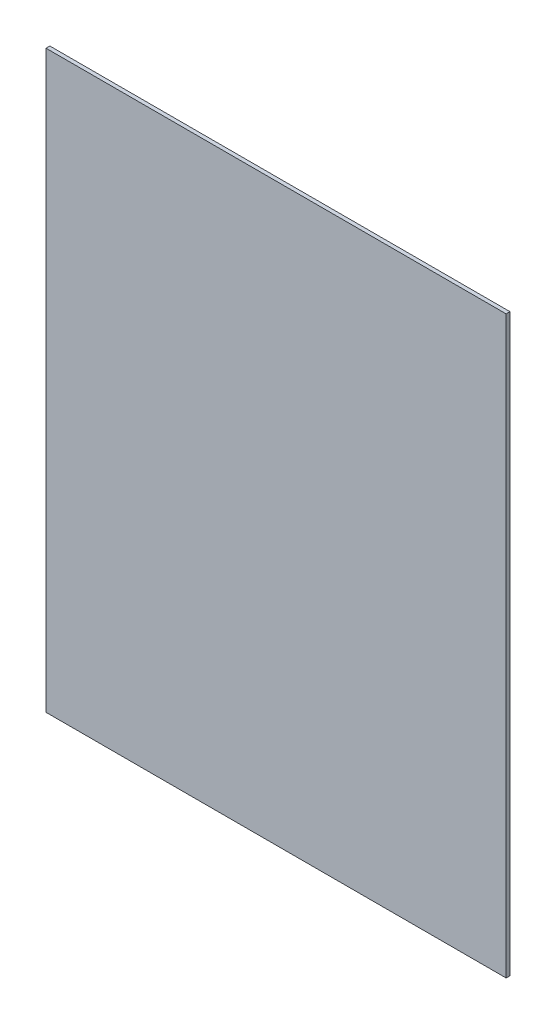
ISO-10303-21;
HEADER;
FILE_DESCRIPTION(('STEP AP214'),'2;1');
FILE_NAME('part.step','',(''),(''),'','','');
FILE_SCHEMA(('AUTOMOTIVE_DESIGN { 1 0 10303 214 1 1 1 1 }'));
ENDSEC;
DATA;
#1=APPLICATION_CONTEXT('core data for automotive mechanical design processes');
#2=APPLICATION_PROTOCOL_DEFINITION('international standard','automotive_design',2000,#1);
#3=PRODUCT_CONTEXT('',#1,'mechanical');
#4=PRODUCT('Part','Part','',(#3));
#5=PRODUCT_RELATED_PRODUCT_CATEGORY('part','',(#4));
#6=PRODUCT_DEFINITION_FORMATION('','',#4);
#7=PRODUCT_DEFINITION_CONTEXT('part definition',#1,'design');
#8=PRODUCT_DEFINITION('design','',#6,#7);
#9=PRODUCT_DEFINITION_SHAPE('','',#8);
#10=(LENGTH_UNIT() NAMED_UNIT(*) SI_UNIT(.MILLI.,.METRE.));
#11=(NAMED_UNIT(*) PLANE_ANGLE_UNIT() SI_UNIT($,.RADIAN.));
#12=(NAMED_UNIT(*) SI_UNIT($,.STERADIAN.) SOLID_ANGLE_UNIT());
#13=UNCERTAINTY_MEASURE_WITH_UNIT(LENGTH_MEASURE(1.E-05),#10,'distance_accuracy_value','');
#14=(GEOMETRIC_REPRESENTATION_CONTEXT(3) GLOBAL_UNCERTAINTY_ASSIGNED_CONTEXT((#13)) GLOBAL_UNIT_ASSIGNED_CONTEXT((#10,
#11,#12)) REPRESENTATION_CONTEXT('',''));
#15=CARTESIAN_POINT('',(0.,0.,0.));
#16=DIRECTION('',(0.,0.,1.));
#17=DIRECTION('',(1.,0.,0.));
#18=AXIS2_PLACEMENT_3D('',#15,#16,#17);
#19=CARTESIAN_POINT('',(0.,0.,-10.));
#20=DIRECTION('',(-1.,0.,0.));
#21=DIRECTION('',(0.,-1.,0.));
#22=AXIS2_PLACEMENT_3D('',#19,#20,#21);
#23=PLANE('',#22);
#24=DIRECTION('',(0.,-1.,0.));
#25=VECTOR('',#24,1.);
#26=CARTESIAN_POINT('',(0.,0.,0.));
#27=LINE('',#26,#25);
#28=CARTESIAN_POINT('',(0.,0.,0.));
#29=VERTEX_POINT('',#28);
#30=CARTESIAN_POINT('',(1.83697019872103E-13,-1500.,0.));
#31=VERTEX_POINT('',#30);
#32=EDGE_CURVE('E102',#29,#31,#27,.T.);
#33=ORIENTED_EDGE('',*,*,#32,.F.);
#34=DIRECTION('',(0.,0.,1.));
#35=VECTOR('',#34,1.);
#36=CARTESIAN_POINT('',(0.,0.,-10.));
#37=LINE('',#36,#35);
#38=CARTESIAN_POINT('',(0.,0.,-10.));
#39=VERTEX_POINT('',#38);
#40=EDGE_CURVE('E11',#39,#29,#37,.T.);
#41=ORIENTED_EDGE('',*,*,#40,.F.);
#42=DIRECTION('',(0.,-1.,0.));
#43=VECTOR('',#42,1.);
#44=CARTESIAN_POINT('',(0.,0.,-10.));
#45=LINE('',#44,#43);
#46=CARTESIAN_POINT('',(1.83697019872103E-13,-1500.,-10.));
#47=VERTEX_POINT('',#46);
#48=EDGE_CURVE('E96',#39,#47,#45,.T.);
#49=ORIENTED_EDGE('',*,*,#48,.T.);
#50=DIRECTION('',(0.,0.,1.));
#51=VECTOR('',#50,1.);
#52=CARTESIAN_POINT('',(1.83697019872103E-13,-1500.,-10.));
#53=LINE('',#52,#51);
#54=EDGE_CURVE('E41',#47,#31,#53,.T.);
#55=ORIENTED_EDGE('',*,*,#54,.T.);
#56=EDGE_LOOP('',(#33,#41,#49,#55));
#57=FACE_BOUND('',#56,.T.);
#58=ADVANCED_FACE('F38',(#57),#23,.T.);
#59=CARTESIAN_POINT('',(0.,0.,-10.));
#60=DIRECTION('',(0.,1.,0.));
#61=DIRECTION('',(0.,0.,1.));
#62=AXIS2_PLACEMENT_3D('',#59,#60,#61);
#63=PLANE('',#62);
#64=DIRECTION('',(-1.,0.,0.));
#65=VECTOR('',#64,1.);
#66=CARTESIAN_POINT('',(0.,0.,0.));
#67=LINE('',#66,#65);
#68=CARTESIAN_POINT('',(1200.,0.,0.));
#69=VERTEX_POINT('',#68);
#70=EDGE_CURVE('E98',#69,#29,#67,.T.);
#71=ORIENTED_EDGE('',*,*,#70,.F.);
#72=DIRECTION('',(0.,0.,1.));
#73=VECTOR('',#72,1.);
#74=CARTESIAN_POINT('',(1200.,0.,-10.));
#75=LINE('',#74,#73);
#76=CARTESIAN_POINT('',(1200.,0.,-10.));
#77=VERTEX_POINT('',#76);
#78=EDGE_CURVE('E47',#77,#69,#75,.T.);
#79=ORIENTED_EDGE('',*,*,#78,.F.);
#80=DIRECTION('',(-1.,0.,0.));
#81=VECTOR('',#80,1.);
#82=CARTESIAN_POINT('',(0.,0.,-10.));
#83=LINE('',#82,#81);
#84=EDGE_CURVE('E93',#77,#39,#83,.T.);
#85=ORIENTED_EDGE('',*,*,#84,.T.);
#86=ORIENTED_EDGE('',*,*,#40,.T.);
#87=EDGE_LOOP('',(#71,#79,#85,#86));
#88=FACE_BOUND('',#87,.T.);
#89=ADVANCED_FACE('F112',(#88),#63,.T.);
#90=CARTESIAN_POINT('',(1200.,0.,-10.));
#91=DIRECTION('',(1.,0.,0.));
#92=DIRECTION('',(0.,1.,0.));
#93=AXIS2_PLACEMENT_3D('',#90,#91,#92);
#94=PLANE('',#93);
#95=DIRECTION('',(0.,1.,0.));
#96=VECTOR('',#95,1.);
#97=CARTESIAN_POINT('',(1200.,0.,0.));
#98=LINE('',#97,#96);
#99=CARTESIAN_POINT('',(1200.,-1500.,0.));
#100=VERTEX_POINT('',#99);
#101=EDGE_CURVE('E88',#100,#69,#98,.T.);
#102=ORIENTED_EDGE('',*,*,#101,.F.);
#103=DIRECTION('',(0.,0.,1.));
#104=VECTOR('',#103,1.);
#105=CARTESIAN_POINT('',(1200.,-1500.,-10.));
#106=LINE('',#105,#104);
#107=CARTESIAN_POINT('',(1200.,-1500.,-10.));
#108=VERTEX_POINT('',#107);
#109=EDGE_CURVE('E83',#108,#100,#106,.T.);
#110=ORIENTED_EDGE('',*,*,#109,.F.);
#111=DIRECTION('',(0.,1.,0.));
#112=VECTOR('',#111,1.);
#113=CARTESIAN_POINT('',(1200.,0.,-10.));
#114=LINE('',#113,#112);
#115=EDGE_CURVE('E86',#108,#77,#114,.T.);
#116=ORIENTED_EDGE('',*,*,#115,.T.);
#117=ORIENTED_EDGE('',*,*,#78,.T.);
#118=EDGE_LOOP('',(#102,#110,#116,#117));
#119=FACE_BOUND('',#118,.T.);
#120=ADVANCED_FACE('F85',(#119),#94,.T.);
#121=CARTESIAN_POINT('',(1.83697019872103E-13,-1500.,-10.));
#122=DIRECTION('',(0.,-1.,0.));
#123=DIRECTION('',(0.,0.,-1.));
#124=AXIS2_PLACEMENT_3D('',#121,#122,#123);
#125=PLANE('',#124);
#126=DIRECTION('',(1.,0.,0.));
#127=VECTOR('',#126,1.);
#128=CARTESIAN_POINT('',(1.83697019872103E-13,-1500.,0.));
#129=LINE('',#128,#127);
#130=EDGE_CURVE('E105',#31,#100,#129,.T.);
#131=ORIENTED_EDGE('',*,*,#130,.F.);
#132=ORIENTED_EDGE('',*,*,#54,.F.);
#133=DIRECTION('',(1.,0.,0.));
#134=VECTOR('',#133,1.);
#135=CARTESIAN_POINT('',(1.83697019872103E-13,-1500.,-10.));
#136=LINE('',#135,#134);
#137=EDGE_CURVE('E92',#47,#108,#136,.T.);
#138=ORIENTED_EDGE('',*,*,#137,.T.);
#139=ORIENTED_EDGE('',*,*,#109,.T.);
#140=EDGE_LOOP('',(#131,#132,#138,#139));
#141=FACE_BOUND('',#140,.T.);
#142=ADVANCED_FACE('F95',(#141),#125,.T.);
#143=CARTESIAN_POINT('',(0.,0.,-10.));
#144=DIRECTION('',(0.,0.,1.));
#145=DIRECTION('',(1.,0.,0.));
#146=AXIS2_PLACEMENT_3D('',#143,#144,#145);
#147=PLANE('',#146);
#148=ORIENTED_EDGE('',*,*,#48,.F.);
#149=ORIENTED_EDGE('',*,*,#84,.F.);
#150=ORIENTED_EDGE('',*,*,#115,.F.);
#151=ORIENTED_EDGE('',*,*,#137,.F.);
#152=EDGE_LOOP('',(#148,#149,#150,#151));
#153=FACE_BOUND('',#152,.T.);
#154=ADVANCED_FACE('F91',(#153),#147,.F.);
#155=CARTESIAN_POINT('',(0.,0.,0.));
#156=DIRECTION('',(0.,0.,1.));
#157=DIRECTION('',(1.,0.,0.));
#158=AXIS2_PLACEMENT_3D('',#155,#156,#157);
#159=PLANE('',#158);
#160=ORIENTED_EDGE('',*,*,#32,.T.);
#161=ORIENTED_EDGE('',*,*,#130,.T.);
#162=ORIENTED_EDGE('',*,*,#101,.T.);
#163=ORIENTED_EDGE('',*,*,#70,.T.);
#164=EDGE_LOOP('',(#160,#161,#162,#163));
#165=FACE_BOUND('',#164,.T.);
#166=ADVANCED_FACE('F111',(#165),#159,.T.);
#167=CLOSED_SHELL('',(#58,#89,#120,#142,#154,#166));
#168=MANIFOLD_SOLID_BREP('B2',#167);
#169=ADVANCED_BREP_SHAPE_REPRESENTATION('',(#18,#168),#14);
#170=SHAPE_DEFINITION_REPRESENTATION(#9,#169);
ENDSEC;
END-ISO-10303-21;
